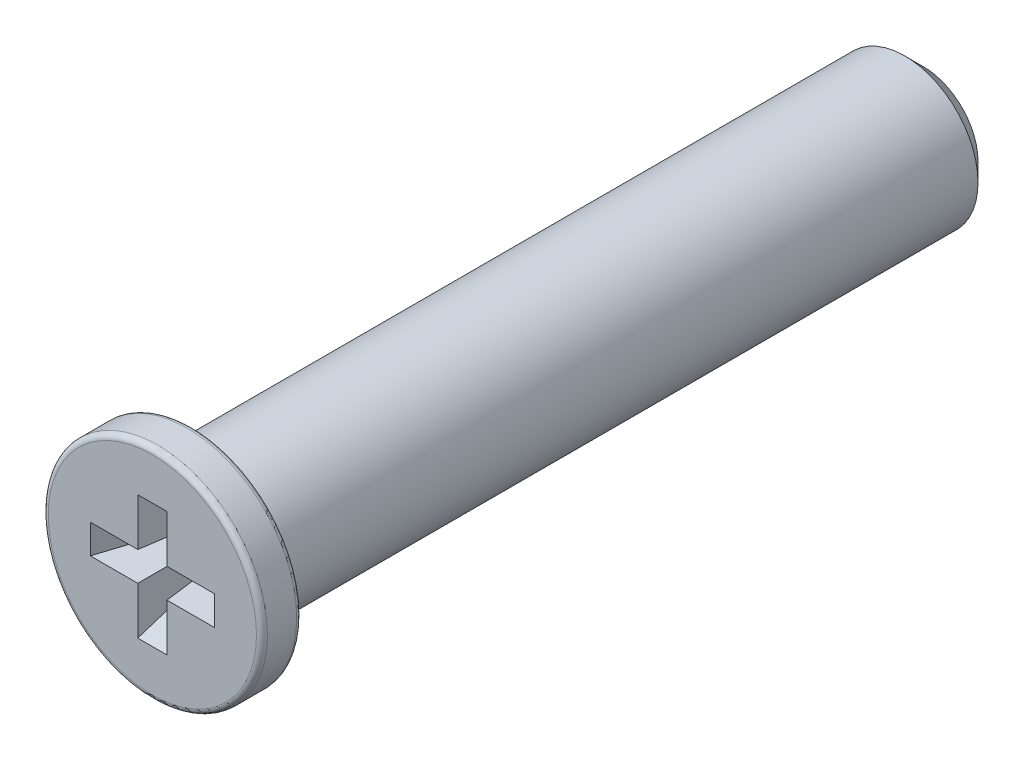
ISO-10303-21;
HEADER;
FILE_DESCRIPTION(('STEP AP214'),'2;1');
FILE_NAME('part.step','',(''),(''),'','','');
FILE_SCHEMA(('AUTOMOTIVE_DESIGN { 1 0 10303 214 1 1 1 1 }'));
ENDSEC;
DATA;
#1=APPLICATION_CONTEXT('core data for automotive mechanical design processes');
#2=APPLICATION_PROTOCOL_DEFINITION('international standard','automotive_design',2000,#1);
#3=PRODUCT_CONTEXT('',#1,'mechanical');
#4=PRODUCT('Part','Part','',(#3));
#5=PRODUCT_RELATED_PRODUCT_CATEGORY('part','',(#4));
#6=PRODUCT_DEFINITION_FORMATION('','',#4);
#7=PRODUCT_DEFINITION_CONTEXT('part definition',#1,'design');
#8=PRODUCT_DEFINITION('design','',#6,#7);
#9=PRODUCT_DEFINITION_SHAPE('','',#8);
#10=(LENGTH_UNIT() NAMED_UNIT(*) SI_UNIT(.MILLI.,.METRE.));
#11=(NAMED_UNIT(*) PLANE_ANGLE_UNIT() SI_UNIT($,.RADIAN.));
#12=(NAMED_UNIT(*) SI_UNIT($,.STERADIAN.) SOLID_ANGLE_UNIT());
#13=UNCERTAINTY_MEASURE_WITH_UNIT(LENGTH_MEASURE(1.E-05),#10,'distance_accuracy_value','');
#14=(GEOMETRIC_REPRESENTATION_CONTEXT(3) GLOBAL_UNCERTAINTY_ASSIGNED_CONTEXT((#13)) GLOBAL_UNIT_ASSIGNED_CONTEXT((#10,
#11,#12)) REPRESENTATION_CONTEXT('',''));
#15=CARTESIAN_POINT('',(0.,0.,0.));
#16=DIRECTION('',(0.,0.,1.));
#17=DIRECTION('',(1.,0.,0.));
#18=AXIS2_PLACEMENT_3D('',#15,#16,#17);
#19=CARTESIAN_POINT('',(-10.4,11.25,7.5));
#20=DIRECTION('',(-0.923879532511287,0.,0.38268343236509));
#21=DIRECTION('',(0.38268343236509,0.,0.923879532511287));
#22=AXIS2_PLACEMENT_3D('',#19,#20,#21);
#23=PLANE('',#22);
#24=DIRECTION('',(0.,1.,0.));
#25=VECTOR('',#24,1.);
#26=CARTESIAN_POINT('',(-10.8970562748477,11.25,6.30000000000001));
#27=LINE('',#26,#25);
#28=CARTESIAN_POINT('',(-10.8970562748477,11.3660878256678,6.3));
#29=VERTEX_POINT('',#28);
#30=CARTESIAN_POINT('',(-10.8970562748477,11.1339121743322,6.3));
#31=VERTEX_POINT('',#30);
#32=EDGE_CURVE('E117',#29,#31,#27,.F.);
#33=ORIENTED_EDGE('',*,*,#32,.T.);
#34=DIRECTION('',(-0.38188732625678,0.0644695530821727,-0.921957562347548));
#35=VECTOR('',#34,1.);
#36=CARTESIAN_POINT('',(-10.4,11.05,7.5));
#37=LINE('',#36,#35);
#38=CARTESIAN_POINT('',(-10.4,11.05,7.5));
#39=VERTEX_POINT('',#38);
#40=EDGE_CURVE('E133',#39,#31,#37,.T.);
#41=ORIENTED_EDGE('',*,*,#40,.F.);
#42=DIRECTION('',(0.,1.,0.));
#43=VECTOR('',#42,1.);
#44=CARTESIAN_POINT('',(-10.4,11.25,7.5));
#45=LINE('',#44,#43);
#46=CARTESIAN_POINT('',(-10.4,11.45,7.5));
#47=VERTEX_POINT('',#46);
#48=EDGE_CURVE('E122',#39,#47,#45,.T.);
#49=ORIENTED_EDGE('',*,*,#48,.T.);
#50=DIRECTION('',(0.38188732625678,0.064469553082174,0.921957562347548));
#51=VECTOR('',#50,1.);
#52=CARTESIAN_POINT('',(-10.8970562748477,11.3660878256678,6.3));
#53=LINE('',#52,#51);
#54=EDGE_CURVE('E286',#29,#47,#53,.T.);
#55=ORIENTED_EDGE('',*,*,#54,.F.);
#56=EDGE_LOOP('',(#33,#41,#49,#55));
#57=FACE_BOUND('',#56,.T.);
#58=ADVANCED_FACE('F17',(#57),#23,.T.);
#59=CARTESIAN_POINT('',(-11.25,11.05,7.5));
#60=DIRECTION('',(0.,0.997564050259824,0.0697564737441253));
#61=DIRECTION('',(0.,-0.0697564737441253,0.997564050259824));
#62=AXIS2_PLACEMENT_3D('',#59,#60,#61);
#63=PLANE('',#62);
#64=DIRECTION('',(1.,0.,0.));
#65=VECTOR('',#64,1.);
#66=CARTESIAN_POINT('',(-11.25,11.1339121743322,6.3));
#67=LINE('',#66,#65);
#68=CARTESIAN_POINT('',(-11.1339121743322,11.1339121743322,6.3));
#69=VERTEX_POINT('',#68);
#70=EDGE_CURVE('E135',#31,#69,#67,.F.);
#71=ORIENTED_EDGE('',*,*,#70,.T.);
#72=DIRECTION('',(-0.0695873743166644,0.0695873743166544,-0.995145815783509));
#73=VECTOR('',#72,1.);
#74=CARTESIAN_POINT('',(-11.05,11.05,7.5));
#75=LINE('',#74,#73);
#76=CARTESIAN_POINT('',(-11.05,11.05,7.5));
#77=VERTEX_POINT('',#76);
#78=EDGE_CURVE('E139',#77,#69,#75,.T.);
#79=ORIENTED_EDGE('',*,*,#78,.F.);
#80=DIRECTION('',(1.,0.,0.));
#81=VECTOR('',#80,1.);
#82=CARTESIAN_POINT('',(-11.25,11.05,7.5));
#83=LINE('',#82,#81);
#84=EDGE_CURVE('E126',#77,#39,#83,.T.);
#85=ORIENTED_EDGE('',*,*,#84,.T.);
#86=ORIENTED_EDGE('',*,*,#40,.T.);
#87=EDGE_LOOP('',(#71,#79,#85,#86));
#88=FACE_BOUND('',#87,.T.);
#89=ADVANCED_FACE('F137',(#88),#63,.T.);
#90=CARTESIAN_POINT('',(-11.25,11.45,7.5));
#91=DIRECTION('',(0.,-0.997564050259824,0.0697564737441253));
#92=DIRECTION('',(0.,-0.0697564737441253,-0.997564050259824));
#93=AXIS2_PLACEMENT_3D('',#90,#91,#92);
#94=PLANE('',#93);
#95=DIRECTION('',(1.,0.,0.));
#96=VECTOR('',#95,1.);
#97=CARTESIAN_POINT('',(-11.25,11.3660878256678,6.3));
#98=LINE('',#97,#96);
#99=CARTESIAN_POINT('',(-11.1339121743322,11.3660878256678,6.3));
#100=VERTEX_POINT('',#99);
#101=EDGE_CURVE('E288',#100,#29,#98,.T.);
#102=ORIENTED_EDGE('',*,*,#101,.T.);
#103=ORIENTED_EDGE('',*,*,#54,.T.);
#104=DIRECTION('',(1.,0.,0.));
#105=VECTOR('',#104,1.);
#106=CARTESIAN_POINT('',(-11.25,11.45,7.5));
#107=LINE('',#106,#105);
#108=CARTESIAN_POINT('',(-11.05,11.45,7.5));
#109=VERTEX_POINT('',#108);
#110=EDGE_CURVE('E129',#47,#109,#107,.F.);
#111=ORIENTED_EDGE('',*,*,#110,.T.);
#112=DIRECTION('',(0.0695873743166644,0.0695873743166544,0.995145815783509));
#113=VECTOR('',#112,1.);
#114=CARTESIAN_POINT('',(-11.1339121743322,11.3660878256678,6.3));
#115=LINE('',#114,#113);
#116=EDGE_CURVE('E272',#100,#109,#115,.T.);
#117=ORIENTED_EDGE('',*,*,#116,.F.);
#118=EDGE_LOOP('',(#102,#103,#111,#117));
#119=FACE_BOUND('',#118,.T.);
#120=ADVANCED_FACE('F459',(#119),#94,.T.);
#121=CARTESIAN_POINT('',(-11.05,11.25,7.5));
#122=DIRECTION('',(-0.997564050259824,0.,0.0697564737441253));
#123=DIRECTION('',(0.0697564737441253,0.,0.997564050259824));
#124=AXIS2_PLACEMENT_3D('',#121,#122,#123);
#125=PLANE('',#124);
#126=DIRECTION('',(0.,1.,0.));
#127=VECTOR('',#126,1.);
#128=CARTESIAN_POINT('',(-11.1339121743322,11.25,6.3));
#129=LINE('',#128,#127);
#130=CARTESIAN_POINT('',(-11.1339121743322,10.8970562748477,6.3));
#131=VERTEX_POINT('',#130);
#132=EDGE_CURVE('E281',#69,#131,#129,.F.);
#133=ORIENTED_EDGE('',*,*,#132,.T.);
#134=DIRECTION('',(-0.0644695530821647,0.381887326256791,-0.921957562347544));
#135=VECTOR('',#134,1.);
#136=CARTESIAN_POINT('',(-11.05,10.4,7.5));
#137=LINE('',#136,#135);
#138=CARTESIAN_POINT('',(-11.05,10.4,7.5));
#139=VERTEX_POINT('',#138);
#140=EDGE_CURVE('E266',#139,#131,#137,.T.);
#141=ORIENTED_EDGE('',*,*,#140,.F.);
#142=DIRECTION('',(0.,1.,0.));
#143=VECTOR('',#142,1.);
#144=CARTESIAN_POINT('',(-11.05,11.25,7.5));
#145=LINE('',#144,#143);
#146=EDGE_CURVE('E284',#139,#77,#145,.T.);
#147=ORIENTED_EDGE('',*,*,#146,.T.);
#148=ORIENTED_EDGE('',*,*,#78,.T.);
#149=EDGE_LOOP('',(#133,#141,#147,#148));
#150=FACE_BOUND('',#149,.T.);
#151=ADVANCED_FACE('F298',(#150),#125,.T.);
#152=CARTESIAN_POINT('',(-11.05,11.25,7.5));
#153=DIRECTION('',(-0.997564050259824,0.,0.0697564737441253));
#154=DIRECTION('',(0.0697564737441253,0.,0.997564050259824));
#155=AXIS2_PLACEMENT_3D('',#152,#153,#154);
#156=PLANE('',#155);
#157=DIRECTION('',(0.,1.,0.));
#158=VECTOR('',#157,1.);
#159=CARTESIAN_POINT('',(-11.1339121743322,11.25,6.3));
#160=LINE('',#159,#158);
#161=CARTESIAN_POINT('',(-11.1339121743322,11.6029437251523,6.3));
#162=VERTEX_POINT('',#161);
#163=EDGE_CURVE('E275',#162,#100,#160,.F.);
#164=ORIENTED_EDGE('',*,*,#163,.T.);
#165=ORIENTED_EDGE('',*,*,#116,.T.);
#166=DIRECTION('',(0.,1.,0.));
#167=VECTOR('',#166,1.);
#168=CARTESIAN_POINT('',(-11.05,11.25,7.5));
#169=LINE('',#168,#167);
#170=CARTESIAN_POINT('',(-11.05,12.1,7.5));
#171=VERTEX_POINT('',#170);
#172=EDGE_CURVE('E278',#109,#171,#169,.T.);
#173=ORIENTED_EDGE('',*,*,#172,.T.);
#174=DIRECTION('',(0.0644695530821646,0.381887326256791,0.921957562347544));
#175=VECTOR('',#174,1.);
#176=CARTESIAN_POINT('',(-11.1339121743322,11.6029437251523,6.30000000000001));
#177=LINE('',#176,#175);
#178=EDGE_CURVE('E255',#162,#171,#177,.T.);
#179=ORIENTED_EDGE('',*,*,#178,.F.);
#180=EDGE_LOOP('',(#164,#165,#173,#179));
#181=FACE_BOUND('',#180,.T.);
#182=ADVANCED_FACE('F445',(#181),#156,.T.);
#183=CARTESIAN_POINT('',(-11.25,10.4,7.5));
#184=DIRECTION('',(0.,0.923879532511287,0.38268343236509));
#185=DIRECTION('',(0.,-0.38268343236509,0.923879532511287));
#186=AXIS2_PLACEMENT_3D('',#183,#184,#185);
#187=PLANE('',#186);
#188=DIRECTION('',(1.,0.,0.));
#189=VECTOR('',#188,1.);
#190=CARTESIAN_POINT('',(-11.25,10.8970562748477,6.30000000000001));
#191=LINE('',#190,#189);
#192=CARTESIAN_POINT('',(-11.3660878256678,10.8970562748477,6.3));
#193=VERTEX_POINT('',#192);
#194=EDGE_CURVE('E264',#131,#193,#191,.F.);
#195=ORIENTED_EDGE('',*,*,#194,.T.);
#196=DIRECTION('',(0.0644695530821727,0.38188732625678,-0.921957562347548));
#197=VECTOR('',#196,1.);
#198=CARTESIAN_POINT('',(-11.45,10.4,7.5));
#199=LINE('',#198,#197);
#200=CARTESIAN_POINT('',(-11.45,10.4,7.5));
#201=VERTEX_POINT('',#200);
#202=EDGE_CURVE('E249',#201,#193,#199,.T.);
#203=ORIENTED_EDGE('',*,*,#202,.F.);
#204=DIRECTION('',(1.,0.,0.));
#205=VECTOR('',#204,1.);
#206=CARTESIAN_POINT('',(-11.25,10.4,7.5));
#207=LINE('',#206,#205);
#208=EDGE_CURVE('E269',#201,#139,#207,.T.);
#209=ORIENTED_EDGE('',*,*,#208,.T.);
#210=ORIENTED_EDGE('',*,*,#140,.T.);
#211=EDGE_LOOP('',(#195,#203,#209,#210));
#212=FACE_BOUND('',#211,.T.);
#213=ADVANCED_FACE('F302',(#212),#187,.T.);
#214=CARTESIAN_POINT('',(-11.25,12.1,7.5));
#215=DIRECTION('',(0.,-0.923879532511287,0.38268343236509));
#216=DIRECTION('',(0.,-0.38268343236509,-0.923879532511287));
#217=AXIS2_PLACEMENT_3D('',#214,#215,#216);
#218=PLANE('',#217);
#219=DIRECTION('',(1.,0.,0.));
#220=VECTOR('',#219,1.);
#221=CARTESIAN_POINT('',(-11.25,11.6029437251523,6.30000000000001));
#222=LINE('',#221,#220);
#223=CARTESIAN_POINT('',(-11.3660878256678,11.6029437251523,6.3));
#224=VERTEX_POINT('',#223);
#225=EDGE_CURVE('E258',#224,#162,#222,.T.);
#226=ORIENTED_EDGE('',*,*,#225,.T.);
#227=ORIENTED_EDGE('',*,*,#178,.T.);
#228=DIRECTION('',(1.,0.,0.));
#229=VECTOR('',#228,1.);
#230=CARTESIAN_POINT('',(-11.25,12.1,7.5));
#231=LINE('',#230,#229);
#232=CARTESIAN_POINT('',(-11.45,12.1,7.5));
#233=VERTEX_POINT('',#232);
#234=EDGE_CURVE('E261',#171,#233,#231,.F.);
#235=ORIENTED_EDGE('',*,*,#234,.T.);
#236=DIRECTION('',(-0.0644695530821739,0.381887326256781,0.921957562347547));
#237=VECTOR('',#236,1.);
#238=CARTESIAN_POINT('',(-11.3660878256678,11.6029437251523,6.3));
#239=LINE('',#238,#237);
#240=EDGE_CURVE('E241',#224,#233,#239,.T.);
#241=ORIENTED_EDGE('',*,*,#240,.F.);
#242=EDGE_LOOP('',(#226,#227,#235,#241));
#243=FACE_BOUND('',#242,.T.);
#244=ADVANCED_FACE('F431',(#243),#218,.T.);
#245=CARTESIAN_POINT('',(-11.45,11.25,7.5));
#246=DIRECTION('',(0.997564050259824,0.,0.0697564737441253));
#247=DIRECTION('',(0.0697564737441253,0.,-0.997564050259824));
#248=AXIS2_PLACEMENT_3D('',#245,#246,#247);
#249=PLANE('',#248);
#250=DIRECTION('',(0.,1.,0.));
#251=VECTOR('',#250,1.);
#252=CARTESIAN_POINT('',(-11.3660878256678,11.25,6.3));
#253=LINE('',#252,#251);
#254=CARTESIAN_POINT('',(-11.3660878256678,11.1339121743322,6.3));
#255=VERTEX_POINT('',#254);
#256=EDGE_CURVE('E247',#193,#255,#253,.T.);
#257=ORIENTED_EDGE('',*,*,#256,.T.);
#258=DIRECTION('',(0.0695873743166544,0.0695873743166644,-0.995145815783509));
#259=VECTOR('',#258,1.);
#260=CARTESIAN_POINT('',(-11.45,11.05,7.5));
#261=LINE('',#260,#259);
#262=CARTESIAN_POINT('',(-11.45,11.05,7.5));
#263=VERTEX_POINT('',#262);
#264=EDGE_CURVE('E235',#263,#255,#261,.T.);
#265=ORIENTED_EDGE('',*,*,#264,.F.);
#266=DIRECTION('',(0.,1.,0.));
#267=VECTOR('',#266,1.);
#268=CARTESIAN_POINT('',(-11.45,11.25,7.5));
#269=LINE('',#268,#267);
#270=EDGE_CURVE('E252',#263,#201,#269,.F.);
#271=ORIENTED_EDGE('',*,*,#270,.T.);
#272=ORIENTED_EDGE('',*,*,#202,.T.);
#273=EDGE_LOOP('',(#257,#265,#271,#272));
#274=FACE_BOUND('',#273,.T.);
#275=ADVANCED_FACE('F304',(#274),#249,.T.);
#276=CARTESIAN_POINT('',(-11.45,11.25,7.5));
#277=DIRECTION('',(0.997564050259824,0.,0.0697564737441253));
#278=DIRECTION('',(0.0697564737441253,0.,-0.997564050259824));
#279=AXIS2_PLACEMENT_3D('',#276,#277,#278);
#280=PLANE('',#279);
#281=DIRECTION('',(0.,1.,0.));
#282=VECTOR('',#281,1.);
#283=CARTESIAN_POINT('',(-11.3660878256678,11.25,6.3));
#284=LINE('',#283,#282);
#285=CARTESIAN_POINT('',(-11.3660878256678,11.3660878256678,6.3));
#286=VERTEX_POINT('',#285);
#287=EDGE_CURVE('E230',#224,#286,#284,.F.);
#288=ORIENTED_EDGE('',*,*,#287,.F.);
#289=ORIENTED_EDGE('',*,*,#240,.T.);
#290=DIRECTION('',(0.,1.,0.));
#291=VECTOR('',#290,1.);
#292=CARTESIAN_POINT('',(-11.45,11.25,7.5));
#293=LINE('',#292,#291);
#294=CARTESIAN_POINT('',(-11.45,11.45,7.5));
#295=VERTEX_POINT('',#294);
#296=EDGE_CURVE('E244',#233,#295,#293,.F.);
#297=ORIENTED_EDGE('',*,*,#296,.T.);
#298=DIRECTION('',(-0.0695873743166544,0.0695873743166644,0.995145815783509));
#299=VECTOR('',#298,1.);
#300=CARTESIAN_POINT('',(-11.3660878256678,11.3660878256678,6.3));
#301=LINE('',#300,#299);
#302=EDGE_CURVE('E222',#286,#295,#301,.T.);
#303=ORIENTED_EDGE('',*,*,#302,.F.);
#304=EDGE_LOOP('',(#288,#289,#297,#303));
#305=FACE_BOUND('',#304,.T.);
#306=ADVANCED_FACE('F417',(#305),#280,.T.);
#307=CARTESIAN_POINT('',(-11.25,11.05,7.5));
#308=DIRECTION('',(0.,0.997564050259824,0.0697564737441253));
#309=DIRECTION('',(0.,-0.0697564737441253,0.997564050259824));
#310=AXIS2_PLACEMENT_3D('',#307,#308,#309);
#311=PLANE('',#310);
#312=DIRECTION('',(1.,0.,0.));
#313=VECTOR('',#312,1.);
#314=CARTESIAN_POINT('',(-11.25,11.1339121743322,6.3));
#315=LINE('',#314,#313);
#316=CARTESIAN_POINT('',(-11.6029437251523,11.1339121743322,6.3));
#317=VERTEX_POINT('',#316);
#318=EDGE_CURVE('E232',#317,#255,#315,.T.);
#319=ORIENTED_EDGE('',*,*,#318,.F.);
#320=DIRECTION('',(0.381887326256791,0.0644695530821646,-0.921957562347544));
#321=VECTOR('',#320,1.);
#322=CARTESIAN_POINT('',(-12.1,11.05,7.5));
#323=LINE('',#322,#321);
#324=CARTESIAN_POINT('',(-12.1,11.05,7.5));
#325=VERTEX_POINT('',#324);
#326=EDGE_CURVE('E219',#325,#317,#323,.T.);
#327=ORIENTED_EDGE('',*,*,#326,.F.);
#328=DIRECTION('',(1.,0.,0.));
#329=VECTOR('',#328,1.);
#330=CARTESIAN_POINT('',(-11.25,11.05,7.5));
#331=LINE('',#330,#329);
#332=EDGE_CURVE('E238',#325,#263,#331,.T.);
#333=ORIENTED_EDGE('',*,*,#332,.T.);
#334=ORIENTED_EDGE('',*,*,#264,.T.);
#335=EDGE_LOOP('',(#319,#327,#333,#334));
#336=FACE_BOUND('',#335,.T.);
#337=ADVANCED_FACE('F307',(#336),#311,.T.);
#338=CARTESIAN_POINT('',(-11.25,11.25,6.3));
#339=DIRECTION('',(0.,0.,1.));
#340=DIRECTION('',(1.,0.,0.));
#341=AXIS2_PLACEMENT_3D('',#338,#339,#340);
#342=PLANE('',#341);
#343=ORIENTED_EDGE('',*,*,#225,.F.);
#344=ORIENTED_EDGE('',*,*,#287,.T.);
#345=DIRECTION('',(1.,0.,0.));
#346=VECTOR('',#345,1.);
#347=CARTESIAN_POINT('',(-11.25,11.3660878256678,6.3));
#348=LINE('',#347,#346);
#349=CARTESIAN_POINT('',(-11.6029437251523,11.3660878256678,6.3));
#350=VERTEX_POINT('',#349);
#351=EDGE_CURVE('E225',#350,#286,#348,.T.);
#352=ORIENTED_EDGE('',*,*,#351,.F.);
#353=DIRECTION('',(0.,1.,0.));
#354=VECTOR('',#353,1.);
#355=CARTESIAN_POINT('',(-11.6029437251523,11.25,6.30000000000001));
#356=LINE('',#355,#354);
#357=EDGE_CURVE('E216',#317,#350,#356,.T.);
#358=ORIENTED_EDGE('',*,*,#357,.F.);
#359=ORIENTED_EDGE('',*,*,#318,.T.);
#360=ORIENTED_EDGE('',*,*,#256,.F.);
#361=ORIENTED_EDGE('',*,*,#194,.F.);
#362=ORIENTED_EDGE('',*,*,#132,.F.);
#363=ORIENTED_EDGE('',*,*,#70,.F.);
#364=ORIENTED_EDGE('',*,*,#32,.F.);
#365=ORIENTED_EDGE('',*,*,#101,.F.);
#366=ORIENTED_EDGE('',*,*,#163,.F.);
#367=EDGE_LOOP('',(#343,#344,#352,#358,#359,#360,#361,#362,#363,#364,#365,#366));
#368=FACE_BOUND('',#367,.T.);
#369=ADVANCED_FACE('F294',(#368),#342,.T.);
#370=CARTESIAN_POINT('',(-11.25,11.45,7.5));
#371=DIRECTION('',(0.,-0.997564050259824,0.0697564737441253));
#372=DIRECTION('',(0.,-0.0697564737441253,-0.997564050259824));
#373=AXIS2_PLACEMENT_3D('',#370,#371,#372);
#374=PLANE('',#373);
#375=ORIENTED_EDGE('',*,*,#351,.T.);
#376=ORIENTED_EDGE('',*,*,#302,.T.);
#377=DIRECTION('',(1.,0.,0.));
#378=VECTOR('',#377,1.);
#379=CARTESIAN_POINT('',(-11.25,11.45,7.5));
#380=LINE('',#379,#378);
#381=CARTESIAN_POINT('',(-12.1,11.45,7.5));
#382=VERTEX_POINT('',#381);
#383=EDGE_CURVE('E228',#295,#382,#380,.F.);
#384=ORIENTED_EDGE('',*,*,#383,.T.);
#385=DIRECTION('',(-0.381887326256791,0.0644695530821646,0.921957562347544));
#386=VECTOR('',#385,1.);
#387=CARTESIAN_POINT('',(-11.6029437251523,11.3660878256678,6.30000000000001));
#388=LINE('',#387,#386);
#389=EDGE_CURVE('E207',#350,#382,#388,.T.);
#390=ORIENTED_EDGE('',*,*,#389,.F.);
#391=EDGE_LOOP('',(#375,#376,#384,#390));
#392=FACE_BOUND('',#391,.T.);
#393=ADVANCED_FACE('F336',(#392),#374,.T.);
#394=CARTESIAN_POINT('',(-12.1,11.25,7.5));
#395=DIRECTION('',(0.923879532511287,0.,0.38268343236509));
#396=DIRECTION('',(0.38268343236509,0.,-0.923879532511287));
#397=AXIS2_PLACEMENT_3D('',#394,#395,#396);
#398=PLANE('',#397);
#399=ORIENTED_EDGE('',*,*,#357,.T.);
#400=ORIENTED_EDGE('',*,*,#389,.T.);
#401=DIRECTION('',(0.,1.,0.));
#402=VECTOR('',#401,1.);
#403=CARTESIAN_POINT('',(-12.1,11.25,7.5));
#404=LINE('',#403,#402);
#405=EDGE_CURVE('E215',#382,#325,#404,.F.);
#406=ORIENTED_EDGE('',*,*,#405,.T.);
#407=ORIENTED_EDGE('',*,*,#326,.T.);
#408=EDGE_LOOP('',(#399,#400,#406,#407));
#409=FACE_BOUND('',#408,.T.);
#410=ADVANCED_FACE('F331',(#409),#398,.T.);
#411=CARTESIAN_POINT('',(-11.25,11.25,7.5));
#412=DIRECTION('',(0.,0.,-1.));
#413=DIRECTION('',(-1.,0.,0.));
#414=AXIS2_PLACEMENT_3D('',#411,#412,#413);
#415=PLANE('',#414);
#416=ORIENTED_EDGE('',*,*,#383,.F.);
#417=ORIENTED_EDGE('',*,*,#296,.F.);
#418=ORIENTED_EDGE('',*,*,#234,.F.);
#419=ORIENTED_EDGE('',*,*,#172,.F.);
#420=ORIENTED_EDGE('',*,*,#110,.F.);
#421=ORIENTED_EDGE('',*,*,#48,.F.);
#422=ORIENTED_EDGE('',*,*,#84,.F.);
#423=ORIENTED_EDGE('',*,*,#146,.F.);
#424=ORIENTED_EDGE('',*,*,#208,.F.);
#425=ORIENTED_EDGE('',*,*,#270,.F.);
#426=ORIENTED_EDGE('',*,*,#332,.F.);
#427=ORIENTED_EDGE('',*,*,#405,.F.);
#428=EDGE_LOOP('',(#416,#417,#418,#419,#420,#421,#422,#423,#424,#425,#426,#427));
#429=FACE_BOUND('',#428,.T.);
#430=CARTESIAN_POINT('',(-11.25,11.25,7.5));
#431=DIRECTION('',(0.,0.,-1.));
#432=DIRECTION('',(-1.,0.,0.));
#433=AXIS2_PLACEMENT_3D('',#430,#431,#432);
#434=CIRCLE('',#433,1.425);
#435=CARTESIAN_POINT('',(-12.675,11.25,7.5));
#436=VERTEX_POINT('',#435);
#437=CARTESIAN_POINT('',(-9.825,11.25,7.5));
#438=VERTEX_POINT('',#437);
#439=EDGE_CURVE('E311',#436,#438,#434,.T.);
#440=ORIENTED_EDGE('',*,*,#439,.F.);
#441=CARTESIAN_POINT('',(-11.25,11.25,7.5));
#442=DIRECTION('',(0.,0.,-1.));
#443=DIRECTION('',(1.,0.,0.));
#444=AXIS2_PLACEMENT_3D('',#441,#442,#443);
#445=CIRCLE('',#444,1.425);
#446=EDGE_CURVE('E187',#438,#436,#445,.T.);
#447=ORIENTED_EDGE('',*,*,#446,.F.);
#448=EDGE_LOOP('',(#440,#447));
#449=FACE_BOUND('',#448,.T.);
#450=ADVANCED_FACE('F123',(#429,#449),#415,.F.);
#451=CARTESIAN_POINT('',(-11.25,11.25,7.425));
#452=DIRECTION('',(0.,0.,-1.));
#453=DIRECTION('',(-1.,0.,0.));
#454=AXIS2_PLACEMENT_3D('',#451,#452,#453);
#455=TOROIDAL_SURFACE('',#454,1.425,0.075);
#456=CARTESIAN_POINT('',(-11.25,11.25,7.425));
#457=DIRECTION('',(0.,0.,1.));
#458=DIRECTION('',(1.,0.,0.));
#459=AXIS2_PLACEMENT_3D('',#456,#457,#458);
#460=CIRCLE('',#459,1.5);
#461=CARTESIAN_POINT('',(-9.75,11.25,7.425));
#462=VERTEX_POINT('',#461);
#463=EDGE_CURVE('E184',#462,#462,#460,.F.);
#464=ORIENTED_EDGE('',*,*,#463,.F.);
#465=EDGE_LOOP('',(#464));
#466=FACE_BOUND('',#465,.T.);
#467=ORIENTED_EDGE('',*,*,#446,.T.);
#468=ORIENTED_EDGE('',*,*,#439,.T.);
#469=EDGE_LOOP('',(#467,#468));
#470=FACE_BOUND('',#469,.T.);
#471=ADVANCED_FACE('F191',(#466,#470),#455,.T.);
#472=CARTESIAN_POINT('',(-11.25,11.25,6.95));
#473=DIRECTION('',(0.,0.,1.));
#474=DIRECTION('',(1.,0.,0.));
#475=AXIS2_PLACEMENT_3D('',#472,#473,#474);
#476=CYLINDRICAL_SURFACE('',#475,1.5);
#477=ORIENTED_EDGE('',*,*,#463,.T.);
#478=EDGE_LOOP('',(#477));
#479=FACE_BOUND('',#478,.T.);
#480=CARTESIAN_POINT('',(-11.25,11.25,7.025));
#481=DIRECTION('',(0.,0.,-1.));
#482=DIRECTION('',(-1.,0.,0.));
#483=AXIS2_PLACEMENT_3D('',#480,#481,#482);
#484=CIRCLE('',#483,1.5);
#485=CARTESIAN_POINT('',(-12.75,11.25,7.025));
#486=VERTEX_POINT('',#485);
#487=EDGE_CURVE('E149',#486,#486,#484,.T.);
#488=ORIENTED_EDGE('',*,*,#487,.F.);
#489=EDGE_LOOP('',(#488));
#490=FACE_BOUND('',#489,.T.);
#491=ADVANCED_FACE('F195',(#479,#490),#476,.T.);
#492=CARTESIAN_POINT('',(-11.25,11.25,-3.05));
#493=DIRECTION('',(0.,0.,-1.));
#494=DIRECTION('',(-1.,0.,0.));
#495=AXIS2_PLACEMENT_3D('',#492,#493,#494);
#496=PLANE('',#495);
#497=CARTESIAN_POINT('',(-11.25,11.25,-3.0500000000302));
#498=DIRECTION('',(0.,0.,1.));
#499=DIRECTION('',(1.,0.,0.));
#500=AXIS2_PLACEMENT_3D('',#497,#498,#499);
#501=CIRCLE('',#500,0.749999999907231);
#502=CARTESIAN_POINT('',(-10.5000000000928,11.25,-3.0500000000302));
#503=VERTEX_POINT('',#502);
#504=EDGE_CURVE('E145',#503,#503,#501,.T.);
#505=ORIENTED_EDGE('',*,*,#504,.F.);
#506=EDGE_LOOP('',(#505));
#507=FACE_BOUND('',#506,.T.);
#508=ADVANCED_FACE('F166',(#507),#496,.T.);
#509=CARTESIAN_POINT('',(-11.25,11.25,7.025));
#510=DIRECTION('',(0.,0.,-1.));
#511=DIRECTION('',(-1.,0.,0.));
#512=AXIS2_PLACEMENT_3D('',#509,#510,#511);
#513=TOROIDAL_SURFACE('',#512,1.425,0.075);
#514=CARTESIAN_POINT('',(-11.25,11.25,6.95));
#515=DIRECTION('',(0.,0.,1.));
#516=DIRECTION('',(1.,0.,0.));
#517=AXIS2_PLACEMENT_3D('',#514,#515,#516);
#518=CIRCLE('',#517,1.425);
#519=CARTESIAN_POINT('',(-12.675,11.25,6.95));
#520=VERTEX_POINT('',#519);
#521=CARTESIAN_POINT('',(-9.825,11.25,6.95));
#522=VERTEX_POINT('',#521);
#523=EDGE_CURVE('E148',#520,#522,#518,.F.);
#524=ORIENTED_EDGE('',*,*,#523,.F.);
#525=CARTESIAN_POINT('',(-11.25,11.25,6.95));
#526=DIRECTION('',(0.,0.,1.));
#527=DIRECTION('',(-1.,0.,0.));
#528=AXIS2_PLACEMENT_3D('',#525,#526,#527);
#529=CIRCLE('',#528,1.425);
#530=EDGE_CURVE('E36',#522,#520,#529,.F.);
#531=ORIENTED_EDGE('',*,*,#530,.F.);
#532=EDGE_LOOP('',(#524,#531));
#533=FACE_BOUND('',#532,.T.);
#534=ORIENTED_EDGE('',*,*,#487,.T.);
#535=EDGE_LOOP('',(#534));
#536=FACE_BOUND('',#535,.T.);
#537=ADVANCED_FACE('F154',(#533,#536),#513,.T.);
#538=CARTESIAN_POINT('',(-11.25,11.25,-2.79999999980873));
#539=DIRECTION('',(0.,0.,1.));
#540=DIRECTION('',(1.,0.,0.));
#541=AXIS2_PLACEMENT_3D('',#538,#539,#540);
#542=CONICAL_SURFACE('',#541,0.999999999730789,0.78539816260164);
#543=ORIENTED_EDGE('',*,*,#504,.T.);
#544=EDGE_LOOP('',(#543));
#545=FACE_BOUND('',#544,.T.);
#546=CARTESIAN_POINT('',(-11.25,11.25,-2.8));
#547=DIRECTION('',(0.,0.,1.));
#548=DIRECTION('',(1.,0.,0.));
#549=AXIS2_PLACEMENT_3D('',#546,#547,#548);
#550=CIRCLE('',#549,1.);
#551=CARTESIAN_POINT('',(-10.25,11.25,-2.8));
#552=VERTEX_POINT('',#551);
#553=EDGE_CURVE('E28',#552,#552,#550,.T.);
#554=ORIENTED_EDGE('',*,*,#553,.F.);
#555=EDGE_LOOP('',(#554));
#556=FACE_BOUND('',#555,.T.);
#557=ADVANCED_FACE('F165',(#545,#556),#542,.T.);
#558=CARTESIAN_POINT('',(-11.25,11.25,6.95));
#559=DIRECTION('',(0.,0.,-1.));
#560=DIRECTION('',(-1.,0.,0.));
#561=AXIS2_PLACEMENT_3D('',#558,#559,#560);
#562=PLANE('',#561);
#563=CARTESIAN_POINT('',(-11.25,11.25,6.95));
#564=DIRECTION('',(0.,0.,1.));
#565=DIRECTION('',(1.,0.,0.));
#566=AXIS2_PLACEMENT_3D('',#563,#564,#565);
#567=CIRCLE('',#566,1.);
#568=CARTESIAN_POINT('',(-10.25,11.25,6.95));
#569=VERTEX_POINT('',#568);
#570=EDGE_CURVE('E11',#569,#569,#567,.F.);
#571=ORIENTED_EDGE('',*,*,#570,.F.);
#572=EDGE_LOOP('',(#571));
#573=FACE_BOUND('',#572,.T.);
#574=ORIENTED_EDGE('',*,*,#523,.T.);
#575=ORIENTED_EDGE('',*,*,#530,.T.);
#576=EDGE_LOOP('',(#574,#575));
#577=FACE_BOUND('',#576,.T.);
#578=ADVANCED_FACE('F339',(#573,#577),#562,.T.);
#579=CARTESIAN_POINT('',(-11.25,11.25,-3.05));
#580=DIRECTION('',(0.,0.,1.));
#581=DIRECTION('',(1.,0.,0.));
#582=AXIS2_PLACEMENT_3D('',#579,#580,#581);
#583=CYLINDRICAL_SURFACE('',#582,1.);
#584=ORIENTED_EDGE('',*,*,#553,.T.);
#585=EDGE_LOOP('',(#584));
#586=FACE_BOUND('',#585,.T.);
#587=ORIENTED_EDGE('',*,*,#570,.T.);
#588=EDGE_LOOP('',(#587));
#589=FACE_BOUND('',#588,.T.);
#590=ADVANCED_FACE('F337',(#586,#589),#583,.T.);
#591=CLOSED_SHELL('',(#58,#89,#120,#151,#182,#213,#244,#275,#306,#337,#369,#393,#410,#450,#471,
#491,#508,#537,#557,#578,#590));
#592=MANIFOLD_SOLID_BREP('B1',#591);
#593=ADVANCED_BREP_SHAPE_REPRESENTATION('',(#18,#592),#14);
#594=SHAPE_DEFINITION_REPRESENTATION(#9,#593);
ENDSEC;
END-ISO-10303-21;
